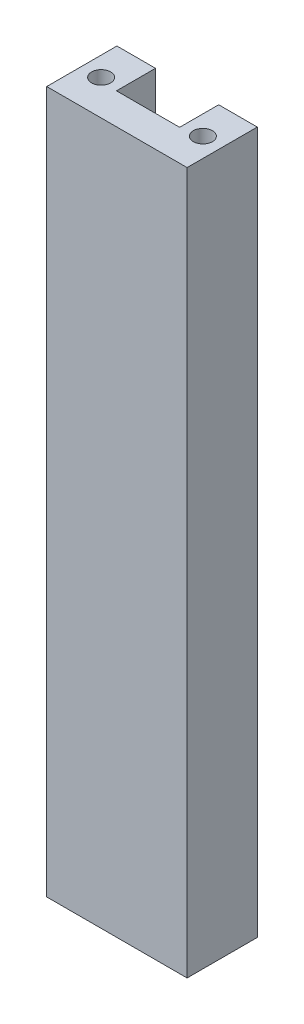
ISO-10303-21;
HEADER;
FILE_DESCRIPTION(('STEP AP214'),'2;1');
FILE_NAME('part.step','',(''),(''),'','','');
FILE_SCHEMA(('AUTOMOTIVE_DESIGN { 1 0 10303 214 1 1 1 1 }'));
ENDSEC;
DATA;
#1=APPLICATION_CONTEXT('core data for automotive mechanical design processes');
#2=APPLICATION_PROTOCOL_DEFINITION('international standard','automotive_design',2000,#1);
#3=PRODUCT_CONTEXT('',#1,'mechanical');
#4=PRODUCT('Part','Part','',(#3));
#5=PRODUCT_RELATED_PRODUCT_CATEGORY('part','',(#4));
#6=PRODUCT_DEFINITION_FORMATION('','',#4);
#7=PRODUCT_DEFINITION_CONTEXT('part definition',#1,'design');
#8=PRODUCT_DEFINITION('design','',#6,#7);
#9=PRODUCT_DEFINITION_SHAPE('','',#8);
#10=(LENGTH_UNIT() NAMED_UNIT(*) SI_UNIT(.MILLI.,.METRE.));
#11=(NAMED_UNIT(*) PLANE_ANGLE_UNIT() SI_UNIT($,.RADIAN.));
#12=(NAMED_UNIT(*) SI_UNIT($,.STERADIAN.) SOLID_ANGLE_UNIT());
#13=UNCERTAINTY_MEASURE_WITH_UNIT(LENGTH_MEASURE(1.E-05),#10,'distance_accuracy_value','');
#14=(GEOMETRIC_REPRESENTATION_CONTEXT(3) GLOBAL_UNCERTAINTY_ASSIGNED_CONTEXT((#13)) GLOBAL_UNIT_ASSIGNED_CONTEXT((#10,
#11,#12)) REPRESENTATION_CONTEXT('',''));
#15=CARTESIAN_POINT('',(0.,0.,0.));
#16=DIRECTION('',(0.,0.,1.));
#17=DIRECTION('',(1.,0.,0.));
#18=AXIS2_PLACEMENT_3D('',#15,#16,#17);
#19=CARTESIAN_POINT('',(0.,127.,0.));
#20=DIRECTION('',(0.,0.,-1.));
#21=DIRECTION('',(-1.,0.,0.));
#22=AXIS2_PLACEMENT_3D('',#19,#20,#21);
#23=PLANE('',#22);
#24=DIRECTION('',(1.,0.,0.));
#25=VECTOR('',#24,1.);
#26=CARTESIAN_POINT('',(0.,0.,0.));
#27=LINE('',#26,#25);
#28=CARTESIAN_POINT('',(18.415,0.,0.));
#29=VERTEX_POINT('',#28);
#30=CARTESIAN_POINT('',(25.4,0.,0.));
#31=VERTEX_POINT('',#30);
#32=EDGE_CURVE('E142',#29,#31,#27,.T.);
#33=ORIENTED_EDGE('',*,*,#32,.F.);
#34=DIRECTION('',(0.,-1.,0.));
#35=VECTOR('',#34,1.);
#36=CARTESIAN_POINT('',(18.415,127.,0.));
#37=LINE('',#36,#35);
#38=CARTESIAN_POINT('',(18.415,127.,0.));
#39=VERTEX_POINT('',#38);
#40=EDGE_CURVE('E11',#39,#29,#37,.T.);
#41=ORIENTED_EDGE('',*,*,#40,.F.);
#42=DIRECTION('',(1.,0.,0.));
#43=VECTOR('',#42,1.);
#44=CARTESIAN_POINT('',(0.,127.,0.));
#45=LINE('',#44,#43);
#46=CARTESIAN_POINT('',(25.4,127.,0.));
#47=VERTEX_POINT('',#46);
#48=EDGE_CURVE('E171',#39,#47,#45,.T.);
#49=ORIENTED_EDGE('',*,*,#48,.T.);
#50=DIRECTION('',(0.,-1.,0.));
#51=VECTOR('',#50,1.);
#52=CARTESIAN_POINT('',(25.4,127.,0.));
#53=LINE('',#52,#51);
#54=EDGE_CURVE('E58',#47,#31,#53,.T.);
#55=ORIENTED_EDGE('',*,*,#54,.T.);
#56=EDGE_LOOP('',(#33,#41,#49,#55));
#57=FACE_BOUND('',#56,.T.);
#58=ADVANCED_FACE('F41',(#57),#23,.T.);
#59=CARTESIAN_POINT('',(18.415,127.,0.));
#60=DIRECTION('',(-1.,0.,0.));
#61=DIRECTION('',(0.,0.,1.));
#62=AXIS2_PLACEMENT_3D('',#59,#60,#61);
#63=PLANE('',#62);
#64=DIRECTION('',(0.,0.,-1.));
#65=VECTOR('',#64,1.);
#66=CARTESIAN_POINT('',(18.415,0.,0.));
#67=LINE('',#66,#65);
#68=CARTESIAN_POINT('',(18.415,0.,7.06518771331058));
#69=VERTEX_POINT('',#68);
#70=EDGE_CURVE('E145',#69,#29,#67,.T.);
#71=ORIENTED_EDGE('',*,*,#70,.F.);
#72=DIRECTION('',(0.,-1.,0.));
#73=VECTOR('',#72,1.);
#74=CARTESIAN_POINT('',(18.415,127.,7.06518771331058));
#75=LINE('',#74,#73);
#76=CARTESIAN_POINT('',(18.415,127.,7.06518771331058));
#77=VERTEX_POINT('',#76);
#78=EDGE_CURVE('E50',#77,#69,#75,.T.);
#79=ORIENTED_EDGE('',*,*,#78,.F.);
#80=DIRECTION('',(0.,0.,-1.));
#81=VECTOR('',#80,1.);
#82=CARTESIAN_POINT('',(18.415,127.,0.));
#83=LINE('',#82,#81);
#84=EDGE_CURVE('E203',#77,#39,#83,.T.);
#85=ORIENTED_EDGE('',*,*,#84,.T.);
#86=ORIENTED_EDGE('',*,*,#40,.T.);
#87=EDGE_LOOP('',(#71,#79,#85,#86));
#88=FACE_BOUND('',#87,.T.);
#89=ADVANCED_FACE('F194',(#88),#63,.T.);
#90=CARTESIAN_POINT('',(0.,127.,7.06518771331058));
#91=DIRECTION('',(0.,0.,-1.));
#92=DIRECTION('',(-1.,0.,0.));
#93=AXIS2_PLACEMENT_3D('',#90,#91,#92);
#94=PLANE('',#93);
#95=DIRECTION('',(1.,0.,0.));
#96=VECTOR('',#95,1.);
#97=CARTESIAN_POINT('',(0.,0.,7.06518771331058));
#98=LINE('',#97,#96);
#99=CARTESIAN_POINT('',(6.985,0.,7.06518771331058));
#100=VERTEX_POINT('',#99);
#101=EDGE_CURVE('E150',#100,#69,#98,.T.);
#102=ORIENTED_EDGE('',*,*,#101,.F.);
#103=DIRECTION('',(0.,-1.,0.));
#104=VECTOR('',#103,1.);
#105=CARTESIAN_POINT('',(6.985,127.,7.06518771331058));
#106=LINE('',#105,#104);
#107=CARTESIAN_POINT('',(6.985,127.,7.06518771331058));
#108=VERTEX_POINT('',#107);
#109=EDGE_CURVE('E181',#108,#100,#106,.T.);
#110=ORIENTED_EDGE('',*,*,#109,.F.);
#111=DIRECTION('',(1.,0.,0.));
#112=VECTOR('',#111,1.);
#113=CARTESIAN_POINT('',(0.,127.,7.06518771331058));
#114=LINE('',#113,#112);
#115=EDGE_CURVE('E190',#108,#77,#114,.T.);
#116=ORIENTED_EDGE('',*,*,#115,.T.);
#117=ORIENTED_EDGE('',*,*,#78,.T.);
#118=EDGE_LOOP('',(#102,#110,#116,#117));
#119=FACE_BOUND('',#118,.T.);
#120=ADVANCED_FACE('F188',(#119),#94,.T.);
#121=CARTESIAN_POINT('',(6.985,127.,0.));
#122=DIRECTION('',(1.,0.,0.));
#123=DIRECTION('',(0.,0.,-1.));
#124=AXIS2_PLACEMENT_3D('',#121,#122,#123);
#125=PLANE('',#124);
#126=DIRECTION('',(0.,0.,1.));
#127=VECTOR('',#126,1.);
#128=CARTESIAN_POINT('',(6.985,0.,0.));
#129=LINE('',#128,#127);
#130=CARTESIAN_POINT('',(6.985,0.,0.));
#131=VERTEX_POINT('',#130);
#132=EDGE_CURVE('E154',#131,#100,#129,.T.);
#133=ORIENTED_EDGE('',*,*,#132,.F.);
#134=DIRECTION('',(0.,-1.,0.));
#135=VECTOR('',#134,1.);
#136=CARTESIAN_POINT('',(6.985,127.,0.));
#137=LINE('',#136,#135);
#138=CARTESIAN_POINT('',(6.985,127.,0.));
#139=VERTEX_POINT('',#138);
#140=EDGE_CURVE('E178',#139,#131,#137,.T.);
#141=ORIENTED_EDGE('',*,*,#140,.F.);
#142=DIRECTION('',(0.,0.,1.));
#143=VECTOR('',#142,1.);
#144=CARTESIAN_POINT('',(6.985,127.,0.));
#145=LINE('',#144,#143);
#146=EDGE_CURVE('E202',#139,#108,#145,.T.);
#147=ORIENTED_EDGE('',*,*,#146,.T.);
#148=ORIENTED_EDGE('',*,*,#109,.T.);
#149=EDGE_LOOP('',(#133,#141,#147,#148));
#150=FACE_BOUND('',#149,.T.);
#151=ADVANCED_FACE('F200',(#150),#125,.T.);
#152=CARTESIAN_POINT('',(0.,127.,0.));
#153=DIRECTION('',(0.,0.,-1.));
#154=DIRECTION('',(-1.,0.,0.));
#155=AXIS2_PLACEMENT_3D('',#152,#153,#154);
#156=PLANE('',#155);
#157=DIRECTION('',(1.,0.,0.));
#158=VECTOR('',#157,1.);
#159=CARTESIAN_POINT('',(0.,0.,0.));
#160=LINE('',#159,#158);
#161=CARTESIAN_POINT('',(0.,0.,0.));
#162=VERTEX_POINT('',#161);
#163=EDGE_CURVE('E158',#162,#131,#160,.T.);
#164=ORIENTED_EDGE('',*,*,#163,.F.);
#165=DIRECTION('',(0.,-1.,0.));
#166=VECTOR('',#165,1.);
#167=CARTESIAN_POINT('',(0.,127.,0.));
#168=LINE('',#167,#166);
#169=CARTESIAN_POINT('',(0.,127.,0.));
#170=VERTEX_POINT('',#169);
#171=EDGE_CURVE('E132',#170,#162,#168,.T.);
#172=ORIENTED_EDGE('',*,*,#171,.F.);
#173=DIRECTION('',(1.,0.,0.));
#174=VECTOR('',#173,1.);
#175=CARTESIAN_POINT('',(0.,127.,0.));
#176=LINE('',#175,#174);
#177=EDGE_CURVE('E120',#170,#139,#176,.T.);
#178=ORIENTED_EDGE('',*,*,#177,.T.);
#179=ORIENTED_EDGE('',*,*,#140,.T.);
#180=EDGE_LOOP('',(#164,#172,#178,#179));
#181=FACE_BOUND('',#180,.T.);
#182=ADVANCED_FACE('F213',(#181),#156,.T.);
#183=CARTESIAN_POINT('',(0.,127.,0.));
#184=DIRECTION('',(1.,0.,0.));
#185=DIRECTION('',(0.,0.,-1.));
#186=AXIS2_PLACEMENT_3D('',#183,#184,#185);
#187=PLANE('',#186);
#188=DIRECTION('',(0.,0.,1.));
#189=VECTOR('',#188,1.);
#190=CARTESIAN_POINT('',(0.,0.,0.));
#191=LINE('',#190,#189);
#192=CARTESIAN_POINT('',(0.,0.,12.7));
#193=VERTEX_POINT('',#192);
#194=EDGE_CURVE('E128',#162,#193,#191,.T.);
#195=ORIENTED_EDGE('',*,*,#194,.T.);
#196=DIRECTION('',(0.,-1.,0.));
#197=VECTOR('',#196,1.);
#198=CARTESIAN_POINT('',(0.,127.,12.7));
#199=LINE('',#198,#197);
#200=CARTESIAN_POINT('',(0.,127.,12.7));
#201=VERTEX_POINT('',#200);
#202=EDGE_CURVE('E125',#201,#193,#199,.T.);
#203=ORIENTED_EDGE('',*,*,#202,.F.);
#204=DIRECTION('',(0.,0.,1.));
#205=VECTOR('',#204,1.);
#206=CARTESIAN_POINT('',(0.,127.,0.));
#207=LINE('',#206,#205);
#208=EDGE_CURVE('E112',#170,#201,#207,.T.);
#209=ORIENTED_EDGE('',*,*,#208,.F.);
#210=ORIENTED_EDGE('',*,*,#171,.T.);
#211=EDGE_LOOP('',(#195,#203,#209,#210));
#212=FACE_BOUND('',#211,.T.);
#213=ADVANCED_FACE('F126',(#212),#187,.F.);
#214=CARTESIAN_POINT('',(0.,127.,12.7));
#215=DIRECTION('',(0.,0.,-1.));
#216=DIRECTION('',(-1.,0.,0.));
#217=AXIS2_PLACEMENT_3D('',#214,#215,#216);
#218=PLANE('',#217);
#219=DIRECTION('',(1.,0.,0.));
#220=VECTOR('',#219,1.);
#221=CARTESIAN_POINT('',(0.,0.,12.7));
#222=LINE('',#221,#220);
#223=CARTESIAN_POINT('',(25.4,0.,12.7));
#224=VERTEX_POINT('',#223);
#225=EDGE_CURVE('E164',#193,#224,#222,.T.);
#226=ORIENTED_EDGE('',*,*,#225,.T.);
#227=DIRECTION('',(0.,-1.,0.));
#228=VECTOR('',#227,1.);
#229=CARTESIAN_POINT('',(25.4,127.,12.7));
#230=LINE('',#229,#228);
#231=CARTESIAN_POINT('',(25.4,127.,12.7));
#232=VERTEX_POINT('',#231);
#233=EDGE_CURVE('E85',#232,#224,#230,.T.);
#234=ORIENTED_EDGE('',*,*,#233,.F.);
#235=DIRECTION('',(1.,0.,0.));
#236=VECTOR('',#235,1.);
#237=CARTESIAN_POINT('',(0.,127.,12.7));
#238=LINE('',#237,#236);
#239=EDGE_CURVE('E117',#201,#232,#238,.T.);
#240=ORIENTED_EDGE('',*,*,#239,.F.);
#241=ORIENTED_EDGE('',*,*,#202,.T.);
#242=EDGE_LOOP('',(#226,#234,#240,#241));
#243=FACE_BOUND('',#242,.T.);
#244=ADVANCED_FACE('F134',(#243),#218,.F.);
#245=CARTESIAN_POINT('',(25.4,127.,0.));
#246=DIRECTION('',(1.,0.,0.));
#247=DIRECTION('',(0.,0.,-1.));
#248=AXIS2_PLACEMENT_3D('',#245,#246,#247);
#249=PLANE('',#248);
#250=DIRECTION('',(0.,0.,1.));
#251=VECTOR('',#250,1.);
#252=CARTESIAN_POINT('',(25.4,0.,0.));
#253=LINE('',#252,#251);
#254=EDGE_CURVE('E167',#31,#224,#253,.T.);
#255=ORIENTED_EDGE('',*,*,#254,.F.);
#256=ORIENTED_EDGE('',*,*,#54,.F.);
#257=DIRECTION('',(0.,0.,1.));
#258=VECTOR('',#257,1.);
#259=CARTESIAN_POINT('',(25.4,127.,0.));
#260=LINE('',#259,#258);
#261=EDGE_CURVE('E136',#47,#232,#260,.T.);
#262=ORIENTED_EDGE('',*,*,#261,.T.);
#263=ORIENTED_EDGE('',*,*,#233,.T.);
#264=EDGE_LOOP('',(#255,#256,#262,#263));
#265=FACE_BOUND('',#264,.T.);
#266=ADVANCED_FACE('F214',(#265),#249,.T.);
#267=CARTESIAN_POINT('',(0.,127.,0.));
#268=DIRECTION('',(0.,1.,0.));
#269=DIRECTION('',(0.,0.,1.));
#270=AXIS2_PLACEMENT_3D('',#267,#268,#269);
#271=PLANE('',#270);
#272=CARTESIAN_POINT('',(3.4925,127.,6.35));
#273=DIRECTION('',(0.,1.,0.));
#274=DIRECTION('',(0.,0.,1.));
#275=AXIS2_PLACEMENT_3D('',#272,#273,#274);
#276=CIRCLE('',#275,1.7272);
#277=CARTESIAN_POINT('',(3.4925,127.,8.0772));
#278=VERTEX_POINT('',#277);
#279=EDGE_CURVE('E355',#278,#278,#276,.T.);
#280=ORIENTED_EDGE('',*,*,#279,.F.);
#281=EDGE_LOOP('',(#280));
#282=FACE_BOUND('',#281,.T.);
#283=CARTESIAN_POINT('',(21.9075,127.,6.35));
#284=DIRECTION('',(0.,1.,0.));
#285=DIRECTION('',(0.,0.,1.));
#286=AXIS2_PLACEMENT_3D('',#283,#284,#285);
#287=CIRCLE('',#286,1.7272);
#288=CARTESIAN_POINT('',(21.9075,127.,8.0772));
#289=VERTEX_POINT('',#288);
#290=EDGE_CURVE('E359',#289,#289,#287,.T.);
#291=ORIENTED_EDGE('',*,*,#290,.F.);
#292=EDGE_LOOP('',(#291));
#293=FACE_BOUND('',#292,.T.);
#294=ORIENTED_EDGE('',*,*,#48,.F.);
#295=ORIENTED_EDGE('',*,*,#84,.F.);
#296=ORIENTED_EDGE('',*,*,#115,.F.);
#297=ORIENTED_EDGE('',*,*,#146,.F.);
#298=ORIENTED_EDGE('',*,*,#177,.F.);
#299=ORIENTED_EDGE('',*,*,#208,.T.);
#300=ORIENTED_EDGE('',*,*,#239,.T.);
#301=ORIENTED_EDGE('',*,*,#261,.F.);
#302=EDGE_LOOP('',(#294,#295,#296,#297,#298,#299,#300,#301));
#303=FACE_BOUND('',#302,.T.);
#304=ADVANCED_FACE('F114',(#282,#293,#303),#271,.T.);
#305=CARTESIAN_POINT('',(0.,0.,0.));
#306=DIRECTION('',(0.,1.,0.));
#307=DIRECTION('',(0.,0.,1.));
#308=AXIS2_PLACEMENT_3D('',#305,#306,#307);
#309=PLANE('',#308);
#310=CARTESIAN_POINT('',(3.4925,0.,6.35));
#311=DIRECTION('',(0.,-1.,0.));
#312=DIRECTION('',(0.,0.,-1.));
#313=AXIS2_PLACEMENT_3D('',#310,#311,#312);
#314=CIRCLE('',#313,1.7272);
#315=CARTESIAN_POINT('',(3.4925,0.,4.6228));
#316=VERTEX_POINT('',#315);
#317=EDGE_CURVE('E369',#316,#316,#314,.T.);
#318=ORIENTED_EDGE('',*,*,#317,.F.);
#319=EDGE_LOOP('',(#318));
#320=FACE_BOUND('',#319,.T.);
#321=CARTESIAN_POINT('',(21.9075,0.,6.35));
#322=DIRECTION('',(0.,-1.,0.));
#323=DIRECTION('',(0.,0.,-1.));
#324=AXIS2_PLACEMENT_3D('',#321,#322,#323);
#325=CIRCLE('',#324,1.7272);
#326=CARTESIAN_POINT('',(21.9075,0.,4.6228));
#327=VERTEX_POINT('',#326);
#328=EDGE_CURVE('E377',#327,#327,#325,.T.);
#329=ORIENTED_EDGE('',*,*,#328,.F.);
#330=EDGE_LOOP('',(#329));
#331=FACE_BOUND('',#330,.T.);
#332=ORIENTED_EDGE('',*,*,#32,.T.);
#333=ORIENTED_EDGE('',*,*,#254,.T.);
#334=ORIENTED_EDGE('',*,*,#225,.F.);
#335=ORIENTED_EDGE('',*,*,#194,.F.);
#336=ORIENTED_EDGE('',*,*,#163,.T.);
#337=ORIENTED_EDGE('',*,*,#132,.T.);
#338=ORIENTED_EDGE('',*,*,#101,.T.);
#339=ORIENTED_EDGE('',*,*,#70,.T.);
#340=EDGE_LOOP('',(#332,#333,#334,#335,#336,#337,#338,#339));
#341=FACE_BOUND('',#340,.T.);
#342=ADVANCED_FACE('F196',(#320,#331,#341),#309,.F.);
#343=CARTESIAN_POINT('',(21.9075,13.97,6.35));
#344=DIRECTION('',(0.,-1.,0.));
#345=DIRECTION('',(0.,0.,-1.));
#346=AXIS2_PLACEMENT_3D('',#343,#344,#345);
#347=CONICAL_SURFACE('',#346,1.7272,1.02974425867665);
#348=CARTESIAN_POINT('',(21.9075,15.0078064611844,6.35));
#349=VERTEX_POINT('',#348);
#350=VERTEX_LOOP('',#349);
#351=FACE_BOUND('',#350,.T.);
#352=CARTESIAN_POINT('',(21.9075,13.97,6.35));
#353=DIRECTION('',(0.,-1.,0.));
#354=DIRECTION('',(0.,0.,-1.));
#355=AXIS2_PLACEMENT_3D('',#352,#353,#354);
#356=CIRCLE('',#355,1.7272);
#357=CARTESIAN_POINT('',(21.9075,13.97,4.6228));
#358=VERTEX_POINT('',#357);
#359=EDGE_CURVE('E146',#358,#358,#356,.T.);
#360=ORIENTED_EDGE('',*,*,#359,.T.);
#361=EDGE_LOOP('',(#360));
#362=FACE_BOUND('',#361,.T.);
#363=ADVANCED_FACE('F261',(#351,#362),#347,.F.);
#364=CARTESIAN_POINT('',(21.9075,0.,6.35));
#365=DIRECTION('',(0.,-1.,0.));
#366=DIRECTION('',(0.,0.,-1.));
#367=AXIS2_PLACEMENT_3D('',#364,#365,#366);
#368=CYLINDRICAL_SURFACE('',#367,1.7272);
#369=ORIENTED_EDGE('',*,*,#359,.F.);
#370=EDGE_LOOP('',(#369));
#371=FACE_BOUND('',#370,.T.);
#372=ORIENTED_EDGE('',*,*,#328,.T.);
#373=EDGE_LOOP('',(#372));
#374=FACE_BOUND('',#373,.T.);
#375=ADVANCED_FACE('F270',(#371,#374),#368,.F.);
#376=CARTESIAN_POINT('',(3.4925,13.97,6.35));
#377=DIRECTION('',(0.,-1.,0.));
#378=DIRECTION('',(0.,0.,-1.));
#379=AXIS2_PLACEMENT_3D('',#376,#377,#378);
#380=CONICAL_SURFACE('',#379,1.7272,1.02974425867665);
#381=CARTESIAN_POINT('',(3.4925,15.0078064611844,6.35));
#382=VERTEX_POINT('',#381);
#383=VERTEX_LOOP('',#382);
#384=FACE_BOUND('',#383,.T.);
#385=CARTESIAN_POINT('',(3.4925,13.97,6.35));
#386=DIRECTION('',(0.,-1.,0.));
#387=DIRECTION('',(0.,0.,-1.));
#388=AXIS2_PLACEMENT_3D('',#385,#386,#387);
#389=CIRCLE('',#388,1.7272);
#390=CARTESIAN_POINT('',(3.4925,13.97,4.6228));
#391=VERTEX_POINT('',#390);
#392=EDGE_CURVE('E373',#391,#391,#389,.T.);
#393=ORIENTED_EDGE('',*,*,#392,.T.);
#394=EDGE_LOOP('',(#393));
#395=FACE_BOUND('',#394,.T.);
#396=ADVANCED_FACE('F280',(#384,#395),#380,.F.);
#397=CARTESIAN_POINT('',(3.4925,0.,6.35));
#398=DIRECTION('',(0.,-1.,0.));
#399=DIRECTION('',(0.,0.,-1.));
#400=AXIS2_PLACEMENT_3D('',#397,#398,#399);
#401=CYLINDRICAL_SURFACE('',#400,1.7272);
#402=ORIENTED_EDGE('',*,*,#392,.F.);
#403=EDGE_LOOP('',(#402));
#404=FACE_BOUND('',#403,.T.);
#405=ORIENTED_EDGE('',*,*,#317,.T.);
#406=EDGE_LOOP('',(#405));
#407=FACE_BOUND('',#406,.T.);
#408=ADVANCED_FACE('F290',(#404,#407),#401,.F.);
#409=CARTESIAN_POINT('',(21.9075,113.03,6.35));
#410=DIRECTION('',(0.,1.,0.));
#411=DIRECTION('',(0.,0.,1.));
#412=AXIS2_PLACEMENT_3D('',#409,#410,#411);
#413=CONICAL_SURFACE('',#412,1.7272,1.02974425867665);
#414=CARTESIAN_POINT('',(21.9075,111.992193538816,6.35));
#415=VERTEX_POINT('',#414);
#416=VERTEX_LOOP('',#415);
#417=FACE_BOUND('',#416,.T.);
#418=CARTESIAN_POINT('',(21.9075,113.03,6.35));
#419=DIRECTION('',(0.,1.,0.));
#420=DIRECTION('',(0.,0.,1.));
#421=AXIS2_PLACEMENT_3D('',#418,#419,#420);
#422=CIRCLE('',#421,1.7272);
#423=CARTESIAN_POINT('',(21.9075,113.03,8.0772));
#424=VERTEX_POINT('',#423);
#425=EDGE_CURVE('E365',#424,#424,#422,.T.);
#426=ORIENTED_EDGE('',*,*,#425,.T.);
#427=EDGE_LOOP('',(#426));
#428=FACE_BOUND('',#427,.T.);
#429=ADVANCED_FACE('F300',(#417,#428),#413,.F.);
#430=CARTESIAN_POINT('',(21.9075,127.,6.35));
#431=DIRECTION('',(0.,1.,0.));
#432=DIRECTION('',(0.,0.,1.));
#433=AXIS2_PLACEMENT_3D('',#430,#431,#432);
#434=CYLINDRICAL_SURFACE('',#433,1.7272);
#435=ORIENTED_EDGE('',*,*,#425,.F.);
#436=EDGE_LOOP('',(#435));
#437=FACE_BOUND('',#436,.T.);
#438=ORIENTED_EDGE('',*,*,#290,.T.);
#439=EDGE_LOOP('',(#438));
#440=FACE_BOUND('',#439,.T.);
#441=ADVANCED_FACE('F315',(#437,#440),#434,.F.);
#442=CARTESIAN_POINT('',(3.4925,113.03,6.35));
#443=DIRECTION('',(0.,1.,0.));
#444=DIRECTION('',(0.,0.,1.));
#445=AXIS2_PLACEMENT_3D('',#442,#443,#444);
#446=CONICAL_SURFACE('',#445,1.7272,1.02974425867665);
#447=CARTESIAN_POINT('',(3.4925,111.992193538816,6.35));
#448=VERTEX_POINT('',#447);
#449=VERTEX_LOOP('',#448);
#450=FACE_BOUND('',#449,.T.);
#451=CARTESIAN_POINT('',(3.4925,113.03,6.35));
#452=DIRECTION('',(0.,1.,0.));
#453=DIRECTION('',(0.,0.,1.));
#454=AXIS2_PLACEMENT_3D('',#451,#452,#453);
#455=CIRCLE('',#454,1.7272);
#456=CARTESIAN_POINT('',(3.4925,113.03,8.0772));
#457=VERTEX_POINT('',#456);
#458=EDGE_CURVE('E352',#457,#457,#455,.T.);
#459=ORIENTED_EDGE('',*,*,#458,.T.);
#460=EDGE_LOOP('',(#459));
#461=FACE_BOUND('',#460,.T.);
#462=ADVANCED_FACE('F325',(#450,#461),#446,.F.);
#463=CARTESIAN_POINT('',(3.4925,127.,6.35));
#464=DIRECTION('',(0.,1.,0.));
#465=DIRECTION('',(0.,0.,1.));
#466=AXIS2_PLACEMENT_3D('',#463,#464,#465);
#467=CYLINDRICAL_SURFACE('',#466,1.7272);
#468=ORIENTED_EDGE('',*,*,#458,.F.);
#469=EDGE_LOOP('',(#468));
#470=FACE_BOUND('',#469,.T.);
#471=ORIENTED_EDGE('',*,*,#279,.T.);
#472=EDGE_LOOP('',(#471));
#473=FACE_BOUND('',#472,.T.);
#474=ADVANCED_FACE('F335',(#470,#473),#467,.F.);
#475=CLOSED_SHELL('',(#58,#89,#120,#151,#182,#213,#244,#266,#304,#342,#363,#375,#396,#408,#429,
#441,#462,#474));
#476=MANIFOLD_SOLID_BREP('B2',#475);
#477=ADVANCED_BREP_SHAPE_REPRESENTATION('',(#18,#476),#14);
#478=SHAPE_DEFINITION_REPRESENTATION(#9,#477);
ENDSEC;
END-ISO-10303-21;
